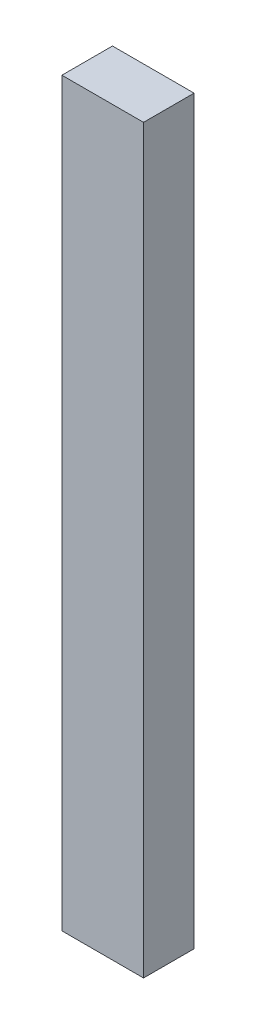
ISO-10303-21;
HEADER;
FILE_DESCRIPTION(('STEP AP214'),'2;1');
FILE_NAME('part.step','',(''),(''),'','','');
FILE_SCHEMA(('AUTOMOTIVE_DESIGN { 1 0 10303 214 1 1 1 1 }'));
ENDSEC;
DATA;
#1=APPLICATION_CONTEXT('core data for automotive mechanical design processes');
#2=APPLICATION_PROTOCOL_DEFINITION('international standard','automotive_design',2000,#1);
#3=PRODUCT_CONTEXT('',#1,'mechanical');
#4=PRODUCT('Part','Part','',(#3));
#5=PRODUCT_RELATED_PRODUCT_CATEGORY('part','',(#4));
#6=PRODUCT_DEFINITION_FORMATION('','',#4);
#7=PRODUCT_DEFINITION_CONTEXT('part definition',#1,'design');
#8=PRODUCT_DEFINITION('design','',#6,#7);
#9=PRODUCT_DEFINITION_SHAPE('','',#8);
#10=(LENGTH_UNIT() NAMED_UNIT(*) SI_UNIT(.MILLI.,.METRE.));
#11=(NAMED_UNIT(*) PLANE_ANGLE_UNIT() SI_UNIT($,.RADIAN.));
#12=(NAMED_UNIT(*) SI_UNIT($,.STERADIAN.) SOLID_ANGLE_UNIT());
#13=UNCERTAINTY_MEASURE_WITH_UNIT(LENGTH_MEASURE(1.E-05),#10,'distance_accuracy_value','');
#14=(GEOMETRIC_REPRESENTATION_CONTEXT(3) GLOBAL_UNCERTAINTY_ASSIGNED_CONTEXT((#13)) GLOBAL_UNIT_ASSIGNED_CONTEXT((#10,
#11,#12)) REPRESENTATION_CONTEXT('',''));
#15=CARTESIAN_POINT('',(0.,0.,0.));
#16=DIRECTION('',(0.,0.,1.));
#17=DIRECTION('',(1.,0.,0.));
#18=AXIS2_PLACEMENT_3D('',#15,#16,#17);
#19=CARTESIAN_POINT('',(173.810306529586,129.252300359681,-38.9997200126349));
#20=DIRECTION('',(0.,0.,-1.));
#21=DIRECTION('',(-1.,0.,0.));
#22=AXIS2_PLACEMENT_3D('',#19,#20,#21);
#23=PLANE('',#22);
#24=DIRECTION('',(0.,1.,0.));
#25=VECTOR('',#24,1.);
#26=CARTESIAN_POINT('',(173.891026940452,129.252300359681,-38.9997200126349));
#27=LINE('',#26,#25);
#28=CARTESIAN_POINT('',(173.891026940452,130.717625928766,-38.9997200126349));
#29=VERTEX_POINT('',#28);
#30=CARTESIAN_POINT('',(173.891026940452,129.252300359681,-38.9997200126349));
#31=VERTEX_POINT('',#30);
#32=EDGE_CURVE('E79',#29,#31,#27,.F.);
#33=ORIENTED_EDGE('',*,*,#32,.F.);
#34=DIRECTION('',(1.,0.,0.));
#35=VECTOR('',#34,1.);
#36=CARTESIAN_POINT('',(173.891026940452,130.717625928766,-38.9997200126349));
#37=LINE('',#36,#35);
#38=CARTESIAN_POINT('',(173.72958611872,130.717625928766,-38.9997200126349));
#39=VERTEX_POINT('',#38);
#40=EDGE_CURVE('E55',#39,#29,#37,.T.);
#41=ORIENTED_EDGE('',*,*,#40,.F.);
#42=DIRECTION('',(0.,1.,0.));
#43=VECTOR('',#42,1.);
#44=CARTESIAN_POINT('',(173.72958611872,130.717625928766,-38.9997200126349));
#45=LINE('',#44,#43);
#46=CARTESIAN_POINT('',(173.72958611872,129.252300359681,-38.9997200126349));
#47=VERTEX_POINT('',#46);
#48=EDGE_CURVE('E57',#47,#39,#45,.T.);
#49=ORIENTED_EDGE('',*,*,#48,.F.);
#50=DIRECTION('',(1.,0.,0.));
#51=VECTOR('',#50,1.);
#52=CARTESIAN_POINT('',(173.72958611872,129.252300359681,-38.9997200126349));
#53=LINE('',#52,#51);
#54=EDGE_CURVE('E20',#31,#47,#53,.F.);
#55=ORIENTED_EDGE('',*,*,#54,.F.);
#56=EDGE_LOOP('',(#33,#41,#49,#55));
#57=FACE_BOUND('',#56,.T.);
#58=ADVANCED_FACE('F17',(#57),#23,.F.);
#59=CARTESIAN_POINT('',(173.72958611872,129.252300359681,-39.0997200126349));
#60=DIRECTION('',(0.,-1.,0.));
#61=DIRECTION('',(0.,0.,-1.));
#62=AXIS2_PLACEMENT_3D('',#59,#60,#61);
#63=PLANE('',#62);
#64=DIRECTION('',(-1.,0.,0.));
#65=VECTOR('',#64,1.);
#66=CARTESIAN_POINT('',(173.810306529586,129.252300359681,-39.0997200126349));
#67=LINE('',#66,#65);
#68=CARTESIAN_POINT('',(173.891026940452,129.252300359681,-39.0997200126349));
#69=VERTEX_POINT('',#68);
#70=CARTESIAN_POINT('',(173.72958611872,129.252300359681,-39.0997200126349));
#71=VERTEX_POINT('',#70);
#72=EDGE_CURVE('E83',#69,#71,#67,.T.);
#73=ORIENTED_EDGE('',*,*,#72,.F.);
#74=DIRECTION('',(0.,0.,-1.));
#75=VECTOR('',#74,1.);
#76=CARTESIAN_POINT('',(173.891026940452,129.252300359681,-39.0997200126349));
#77=LINE('',#76,#75);
#78=EDGE_CURVE('E68',#31,#69,#77,.T.);
#79=ORIENTED_EDGE('',*,*,#78,.F.);
#80=ORIENTED_EDGE('',*,*,#54,.T.);
#81=DIRECTION('',(0.,0.,1.));
#82=VECTOR('',#81,1.);
#83=CARTESIAN_POINT('',(173.72958611872,129.252300359681,-39.0997200126349));
#84=LINE('',#83,#82);
#85=EDGE_CURVE('E63',#71,#47,#84,.T.);
#86=ORIENTED_EDGE('',*,*,#85,.F.);
#87=EDGE_LOOP('',(#73,#79,#80,#86));
#88=FACE_BOUND('',#87,.T.);
#89=ADVANCED_FACE('F65',(#88),#63,.T.);
#90=CARTESIAN_POINT('',(173.72958611872,130.717625928766,-39.0997200126349));
#91=DIRECTION('',(-1.,0.,0.));
#92=DIRECTION('',(0.,0.,1.));
#93=AXIS2_PLACEMENT_3D('',#90,#91,#92);
#94=PLANE('',#93);
#95=DIRECTION('',(0.,1.,0.));
#96=VECTOR('',#95,1.);
#97=CARTESIAN_POINT('',(173.72958611872,129.252300359681,-39.0997200126349));
#98=LINE('',#97,#96);
#99=CARTESIAN_POINT('',(173.72958611872,130.717625928766,-39.0997200126349));
#100=VERTEX_POINT('',#99);
#101=EDGE_CURVE('E72',#71,#100,#98,.T.);
#102=ORIENTED_EDGE('',*,*,#101,.F.);
#103=ORIENTED_EDGE('',*,*,#85,.T.);
#104=ORIENTED_EDGE('',*,*,#48,.T.);
#105=DIRECTION('',(0.,0.,1.));
#106=VECTOR('',#105,1.);
#107=CARTESIAN_POINT('',(173.72958611872,130.717625928766,-39.0997200126349));
#108=LINE('',#107,#106);
#109=EDGE_CURVE('E75',#100,#39,#108,.T.);
#110=ORIENTED_EDGE('',*,*,#109,.F.);
#111=EDGE_LOOP('',(#102,#103,#104,#110));
#112=FACE_BOUND('',#111,.T.);
#113=ADVANCED_FACE('F70',(#112),#94,.T.);
#114=CARTESIAN_POINT('',(173.891026940452,130.717625928766,-39.0997200126349));
#115=DIRECTION('',(0.,1.,0.));
#116=DIRECTION('',(0.,0.,1.));
#117=AXIS2_PLACEMENT_3D('',#114,#115,#116);
#118=PLANE('',#117);
#119=DIRECTION('',(-1.,0.,0.));
#120=VECTOR('',#119,1.);
#121=CARTESIAN_POINT('',(173.810306529586,130.717625928766,-39.0997200126349));
#122=LINE('',#121,#120);
#123=CARTESIAN_POINT('',(173.891026940452,130.717625928766,-39.0997200126349));
#124=VERTEX_POINT('',#123);
#125=EDGE_CURVE('E26',#100,#124,#122,.F.);
#126=ORIENTED_EDGE('',*,*,#125,.F.);
#127=ORIENTED_EDGE('',*,*,#109,.T.);
#128=ORIENTED_EDGE('',*,*,#40,.T.);
#129=DIRECTION('',(0.,0.,-1.));
#130=VECTOR('',#129,1.);
#131=CARTESIAN_POINT('',(173.891026940452,130.717625928766,-39.0997200126349));
#132=LINE('',#131,#130);
#133=EDGE_CURVE('E35',#124,#29,#132,.F.);
#134=ORIENTED_EDGE('',*,*,#133,.F.);
#135=EDGE_LOOP('',(#126,#127,#128,#134));
#136=FACE_BOUND('',#135,.T.);
#137=ADVANCED_FACE('F89',(#136),#118,.T.);
#138=CARTESIAN_POINT('',(173.891026940452,129.252300359681,-39.0997200126349));
#139=DIRECTION('',(1.,0.,0.));
#140=DIRECTION('',(0.,0.,-1.));
#141=AXIS2_PLACEMENT_3D('',#138,#139,#140);
#142=PLANE('',#141);
#143=DIRECTION('',(0.,1.,0.));
#144=VECTOR('',#143,1.);
#145=CARTESIAN_POINT('',(173.891026940452,129.252300359681,-39.0997200126349));
#146=LINE('',#145,#144);
#147=EDGE_CURVE('E11',#124,#69,#146,.F.);
#148=ORIENTED_EDGE('',*,*,#147,.F.);
#149=ORIENTED_EDGE('',*,*,#133,.T.);
#150=ORIENTED_EDGE('',*,*,#32,.T.);
#151=ORIENTED_EDGE('',*,*,#78,.T.);
#152=EDGE_LOOP('',(#148,#149,#150,#151));
#153=FACE_BOUND('',#152,.T.);
#154=ADVANCED_FACE('F91',(#153),#142,.T.);
#155=CARTESIAN_POINT('',(173.810306529586,129.252300359681,-39.0997200126349));
#156=DIRECTION('',(0.,0.,-1.));
#157=DIRECTION('',(-1.,0.,0.));
#158=AXIS2_PLACEMENT_3D('',#155,#156,#157);
#159=PLANE('',#158);
#160=ORIENTED_EDGE('',*,*,#125,.T.);
#161=ORIENTED_EDGE('',*,*,#147,.T.);
#162=ORIENTED_EDGE('',*,*,#72,.T.);
#163=ORIENTED_EDGE('',*,*,#101,.T.);
#164=EDGE_LOOP('',(#160,#161,#162,#163));
#165=FACE_BOUND('',#164,.T.);
#166=ADVANCED_FACE('F88',(#165),#159,.T.);
#167=CLOSED_SHELL('',(#58,#89,#113,#137,#154,#166));
#168=MANIFOLD_SOLID_BREP('B1',#167);
#169=ADVANCED_BREP_SHAPE_REPRESENTATION('',(#18,#168),#14);
#170=SHAPE_DEFINITION_REPRESENTATION(#9,#169);
ENDSEC;
END-ISO-10303-21;
